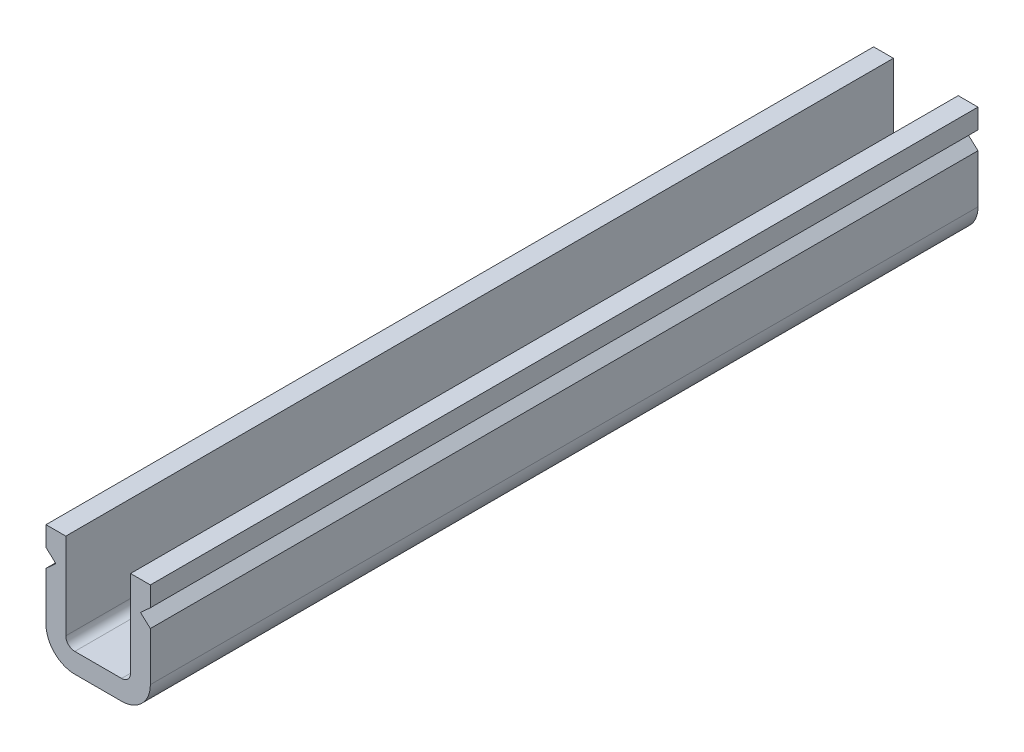
ISO-10303-21;
HEADER;
FILE_DESCRIPTION(('STEP AP214'),'2;1');
FILE_NAME('part.step','',(''),(''),'','','');
FILE_SCHEMA(('AUTOMOTIVE_DESIGN { 1 0 10303 214 1 1 1 1 }'));
ENDSEC;
DATA;
#1=APPLICATION_CONTEXT('core data for automotive mechanical design processes');
#2=APPLICATION_PROTOCOL_DEFINITION('international standard','automotive_design',2000,#1);
#3=PRODUCT_CONTEXT('',#1,'mechanical');
#4=PRODUCT('Part','Part','',(#3));
#5=PRODUCT_RELATED_PRODUCT_CATEGORY('part','',(#4));
#6=PRODUCT_DEFINITION_FORMATION('','',#4);
#7=PRODUCT_DEFINITION_CONTEXT('part definition',#1,'design');
#8=PRODUCT_DEFINITION('design','',#6,#7);
#9=PRODUCT_DEFINITION_SHAPE('','',#8);
#10=(LENGTH_UNIT() NAMED_UNIT(*) SI_UNIT(.MILLI.,.METRE.));
#11=(NAMED_UNIT(*) PLANE_ANGLE_UNIT() SI_UNIT($,.RADIAN.));
#12=(NAMED_UNIT(*) SI_UNIT($,.STERADIAN.) SOLID_ANGLE_UNIT());
#13=UNCERTAINTY_MEASURE_WITH_UNIT(LENGTH_MEASURE(1.E-05),#10,'distance_accuracy_value','');
#14=(GEOMETRIC_REPRESENTATION_CONTEXT(3) GLOBAL_UNCERTAINTY_ASSIGNED_CONTEXT((#13)) GLOBAL_UNIT_ASSIGNED_CONTEXT((#10,
#11,#12)) REPRESENTATION_CONTEXT('',''));
#15=CARTESIAN_POINT('',(0.,0.,0.));
#16=DIRECTION('',(0.,0.,1.));
#17=DIRECTION('',(1.,0.,0.));
#18=AXIS2_PLACEMENT_3D('',#15,#16,#17);
#19=CARTESIAN_POINT('',(1.09999999999999,0.,46.));
#20=DIRECTION('',(0.,-1.,0.));
#21=DIRECTION('',(1.,0.,0.));
#22=AXIS2_PLACEMENT_3D('',#19,#20,#21);
#23=PLANE('',#22);
#24=DIRECTION('',(-1.,0.,0.));
#25=VECTOR('',#24,1.);
#26=CARTESIAN_POINT('',(1.09999999999999,0.,0.));
#27=LINE('',#26,#25);
#28=CARTESIAN_POINT('',(1.09999999999999,0.,0.));
#29=VERTEX_POINT('',#28);
#30=CARTESIAN_POINT('',(0.,0.,0.));
#31=VERTEX_POINT('',#30);
#32=EDGE_CURVE('E187',#29,#31,#27,.T.);
#33=ORIENTED_EDGE('',*,*,#32,.T.);
#34=DIRECTION('',(0.,0.,-1.));
#35=VECTOR('',#34,1.);
#36=CARTESIAN_POINT('',(0.,0.,46.));
#37=LINE('',#36,#35);
#38=CARTESIAN_POINT('',(0.,0.,46.));
#39=VERTEX_POINT('',#38);
#40=EDGE_CURVE('E11',#39,#31,#37,.T.);
#41=ORIENTED_EDGE('',*,*,#40,.F.);
#42=DIRECTION('',(-1.,0.,0.));
#43=VECTOR('',#42,1.);
#44=CARTESIAN_POINT('',(1.09999999999999,0.,46.));
#45=LINE('',#44,#43);
#46=CARTESIAN_POINT('',(1.09999999999999,0.,46.));
#47=VERTEX_POINT('',#46);
#48=EDGE_CURVE('E221',#47,#39,#45,.T.);
#49=ORIENTED_EDGE('',*,*,#48,.F.);
#50=DIRECTION('',(0.,0.,-1.));
#51=VECTOR('',#50,1.);
#52=CARTESIAN_POINT('',(1.09999999999999,0.,46.));
#53=LINE('',#52,#51);
#54=EDGE_CURVE('E183',#47,#29,#53,.T.);
#55=ORIENTED_EDGE('',*,*,#54,.T.);
#56=EDGE_LOOP('',(#33,#41,#49,#55));
#57=FACE_BOUND('',#56,.T.);
#58=ADVANCED_FACE('F31',(#57),#23,.F.);
#59=CARTESIAN_POINT('',(0.,0.,46.));
#60=DIRECTION('',(1.,0.,0.));
#61=DIRECTION('',(0.,0.,-1.));
#62=AXIS2_PLACEMENT_3D('',#59,#60,#61);
#63=PLANE('',#62);
#64=DIRECTION('',(0.,-1.,0.));
#65=VECTOR('',#64,1.);
#66=CARTESIAN_POINT('',(0.,0.,0.));
#67=LINE('',#66,#65);
#68=CARTESIAN_POINT('',(0.,-1.1,0.));
#69=VERTEX_POINT('',#68);
#70=EDGE_CURVE('E190',#31,#69,#67,.T.);
#71=ORIENTED_EDGE('',*,*,#70,.T.);
#72=DIRECTION('',(0.,0.,-1.));
#73=VECTOR('',#72,1.);
#74=CARTESIAN_POINT('',(0.,-1.1,46.));
#75=LINE('',#74,#73);
#76=CARTESIAN_POINT('',(0.,-1.1,46.));
#77=VERTEX_POINT('',#76);
#78=EDGE_CURVE('E39',#77,#69,#75,.T.);
#79=ORIENTED_EDGE('',*,*,#78,.F.);
#80=DIRECTION('',(0.,-1.,0.));
#81=VECTOR('',#80,1.);
#82=CARTESIAN_POINT('',(0.,0.,46.));
#83=LINE('',#82,#81);
#84=EDGE_CURVE('E120',#39,#77,#83,.T.);
#85=ORIENTED_EDGE('',*,*,#84,.F.);
#86=ORIENTED_EDGE('',*,*,#40,.T.);
#87=EDGE_LOOP('',(#71,#79,#85,#86));
#88=FACE_BOUND('',#87,.T.);
#89=ADVANCED_FACE('F329',(#88),#63,.F.);
#90=CARTESIAN_POINT('',(0.,-1.1,46.));
#91=DIRECTION('',(0.672672793996313,0.739940073395944,0.));
#92=DIRECTION('',(-0.739940073395944,0.672672793996313,0.));
#93=AXIS2_PLACEMENT_3D('',#90,#91,#92);
#94=PLANE('',#93);
#95=DIRECTION('',(0.739940073395943,-0.672672793996313,0.));
#96=VECTOR('',#95,1.);
#97=CARTESIAN_POINT('',(0.,-1.1,0.));
#98=LINE('',#97,#96);
#99=CARTESIAN_POINT('',(0.549999999999995,-1.6,0.));
#100=VERTEX_POINT('',#99);
#101=EDGE_CURVE('E192',#69,#100,#98,.T.);
#102=ORIENTED_EDGE('',*,*,#101,.T.);
#103=DIRECTION('',(0.,0.,-1.));
#104=VECTOR('',#103,1.);
#105=CARTESIAN_POINT('',(0.549999999999995,-1.6,46.));
#106=LINE('',#105,#104);
#107=CARTESIAN_POINT('',(0.549999999999995,-1.6,46.));
#108=VERTEX_POINT('',#107);
#109=EDGE_CURVE('E258',#108,#100,#106,.T.);
#110=ORIENTED_EDGE('',*,*,#109,.F.);
#111=DIRECTION('',(0.739940073395943,-0.672672793996313,0.));
#112=VECTOR('',#111,1.);
#113=CARTESIAN_POINT('',(0.,-1.1,46.));
#114=LINE('',#113,#112);
#115=EDGE_CURVE('E266',#77,#108,#114,.T.);
#116=ORIENTED_EDGE('',*,*,#115,.F.);
#117=ORIENTED_EDGE('',*,*,#78,.T.);
#118=EDGE_LOOP('',(#102,#110,#116,#117));
#119=FACE_BOUND('',#118,.T.);
#120=ADVANCED_FACE('F264',(#119),#94,.F.);
#121=CARTESIAN_POINT('',(0.,-2.1,46.));
#122=DIRECTION('',(0.672672793996316,-0.739940073395941,0.));
#123=DIRECTION('',(0.739940073395941,0.672672793996316,0.));
#124=AXIS2_PLACEMENT_3D('',#121,#122,#123);
#125=PLANE('',#124);
#126=DIRECTION('',(-0.739940073395941,-0.672672793996316,0.));
#127=VECTOR('',#126,1.);
#128=CARTESIAN_POINT('',(0.,-2.1,0.));
#129=LINE('',#128,#127);
#130=CARTESIAN_POINT('',(0.,-2.1,0.));
#131=VERTEX_POINT('',#130);
#132=EDGE_CURVE('E194',#100,#131,#129,.T.);
#133=ORIENTED_EDGE('',*,*,#132,.T.);
#134=DIRECTION('',(0.,0.,-1.));
#135=VECTOR('',#134,1.);
#136=CARTESIAN_POINT('',(0.,-2.1,46.));
#137=LINE('',#136,#135);
#138=CARTESIAN_POINT('',(0.,-2.1,46.));
#139=VERTEX_POINT('',#138);
#140=EDGE_CURVE('E255',#139,#131,#137,.T.);
#141=ORIENTED_EDGE('',*,*,#140,.F.);
#142=DIRECTION('',(-0.739940073395941,-0.672672793996316,0.));
#143=VECTOR('',#142,1.);
#144=CARTESIAN_POINT('',(0.,-2.1,46.));
#145=LINE('',#144,#143);
#146=EDGE_CURVE('E284',#108,#139,#145,.T.);
#147=ORIENTED_EDGE('',*,*,#146,.F.);
#148=ORIENTED_EDGE('',*,*,#109,.T.);
#149=EDGE_LOOP('',(#133,#141,#147,#148));
#150=FACE_BOUND('',#149,.T.);
#151=ADVANCED_FACE('F275',(#150),#125,.F.);
#152=CARTESIAN_POINT('',(0.,-2.1,46.));
#153=DIRECTION('',(1.,0.,0.));
#154=DIRECTION('',(0.,1.,0.));
#155=AXIS2_PLACEMENT_3D('',#152,#153,#154);
#156=PLANE('',#155);
#157=DIRECTION('',(0.,-1.,0.));
#158=VECTOR('',#157,1.);
#159=CARTESIAN_POINT('',(0.,-2.1,0.));
#160=LINE('',#159,#158);
#161=CARTESIAN_POINT('',(0.,-4.79999999999998,0.));
#162=VERTEX_POINT('',#161);
#163=EDGE_CURVE('E196',#131,#162,#160,.T.);
#164=ORIENTED_EDGE('',*,*,#163,.T.);
#165=DIRECTION('',(0.,0.,-1.));
#166=VECTOR('',#165,1.);
#167=CARTESIAN_POINT('',(0.,-4.79999999999998,46.));
#168=LINE('',#167,#166);
#169=CARTESIAN_POINT('',(0.,-4.79999999999998,46.));
#170=VERTEX_POINT('',#169);
#171=EDGE_CURVE('E252',#170,#162,#168,.T.);
#172=ORIENTED_EDGE('',*,*,#171,.F.);
#173=DIRECTION('',(0.,-1.,0.));
#174=VECTOR('',#173,1.);
#175=CARTESIAN_POINT('',(0.,-2.1,46.));
#176=LINE('',#175,#174);
#177=EDGE_CURVE('E281',#139,#170,#176,.T.);
#178=ORIENTED_EDGE('',*,*,#177,.F.);
#179=ORIENTED_EDGE('',*,*,#140,.T.);
#180=EDGE_LOOP('',(#164,#172,#178,#179));
#181=FACE_BOUND('',#180,.T.);
#182=ADVANCED_FACE('F279',(#181),#156,.F.);
#183=CARTESIAN_POINT('',(1.6,-4.79999999999998,46.));
#184=DIRECTION('',(0.,0.,-1.));
#185=DIRECTION('',(-1.,0.,0.));
#186=AXIS2_PLACEMENT_3D('',#183,#184,#185);
#187=CYLINDRICAL_SURFACE('',#186,1.6);
#188=CARTESIAN_POINT('',(1.6,-4.79999999999998,0.));
#189=DIRECTION('',(0.,0.,1.));
#190=DIRECTION('',(1.,0.,0.));
#191=AXIS2_PLACEMENT_3D('',#188,#189,#190);
#192=CIRCLE('',#191,1.6);
#193=CARTESIAN_POINT('',(1.6,-6.39999999999998,0.));
#194=VERTEX_POINT('',#193);
#195=EDGE_CURVE('E198',#162,#194,#192,.T.);
#196=ORIENTED_EDGE('',*,*,#195,.T.);
#197=DIRECTION('',(0.,0.,-1.));
#198=VECTOR('',#197,1.);
#199=CARTESIAN_POINT('',(1.6,-6.39999999999998,46.));
#200=LINE('',#199,#198);
#201=CARTESIAN_POINT('',(1.6,-6.39999999999998,46.));
#202=VERTEX_POINT('',#201);
#203=EDGE_CURVE('E249',#202,#194,#200,.T.);
#204=ORIENTED_EDGE('',*,*,#203,.F.);
#205=CARTESIAN_POINT('',(1.6,-4.79999999999998,46.));
#206=DIRECTION('',(0.,0.,1.));
#207=DIRECTION('',(1.,0.,0.));
#208=AXIS2_PLACEMENT_3D('',#205,#206,#207);
#209=CIRCLE('',#208,1.6);
#210=EDGE_CURVE('E283',#170,#202,#209,.T.);
#211=ORIENTED_EDGE('',*,*,#210,.F.);
#212=ORIENTED_EDGE('',*,*,#171,.T.);
#213=EDGE_LOOP('',(#196,#204,#211,#212));
#214=FACE_BOUND('',#213,.T.);
#215=ADVANCED_FACE('F342',(#214),#187,.T.);
#216=CARTESIAN_POINT('',(1.6,-6.39999999999998,46.));
#217=DIRECTION('',(0.,1.,0.));
#218=DIRECTION('',(0.,0.,1.));
#219=AXIS2_PLACEMENT_3D('',#216,#217,#218);
#220=PLANE('',#219);
#221=DIRECTION('',(1.,0.,0.));
#222=VECTOR('',#221,1.);
#223=CARTESIAN_POINT('',(1.6,-6.39999999999998,0.));
#224=LINE('',#223,#222);
#225=CARTESIAN_POINT('',(4.19999999999997,-6.39999999999998,0.));
#226=VERTEX_POINT('',#225);
#227=EDGE_CURVE('E200',#194,#226,#224,.T.);
#228=ORIENTED_EDGE('',*,*,#227,.T.);
#229=DIRECTION('',(0.,0.,-1.));
#230=VECTOR('',#229,1.);
#231=CARTESIAN_POINT('',(4.19999999999997,-6.39999999999998,46.));
#232=LINE('',#231,#230);
#233=CARTESIAN_POINT('',(4.19999999999997,-6.39999999999998,46.));
#234=VERTEX_POINT('',#233);
#235=EDGE_CURVE('E246',#234,#226,#232,.T.);
#236=ORIENTED_EDGE('',*,*,#235,.F.);
#237=DIRECTION('',(1.,0.,0.));
#238=VECTOR('',#237,1.);
#239=CARTESIAN_POINT('',(1.6,-6.39999999999998,46.));
#240=LINE('',#239,#238);
#241=EDGE_CURVE('E286',#202,#234,#240,.T.);
#242=ORIENTED_EDGE('',*,*,#241,.F.);
#243=ORIENTED_EDGE('',*,*,#203,.T.);
#244=EDGE_LOOP('',(#228,#236,#242,#243));
#245=FACE_BOUND('',#244,.T.);
#246=ADVANCED_FACE('F345',(#245),#220,.F.);
#247=CARTESIAN_POINT('',(4.19999999999997,-4.79999999999998,46.));
#248=DIRECTION('',(0.,0.,-1.));
#249=DIRECTION('',(-1.,0.,0.));
#250=AXIS2_PLACEMENT_3D('',#247,#248,#249);
#251=CYLINDRICAL_SURFACE('',#250,1.6);
#252=CARTESIAN_POINT('',(4.19999999999997,-4.79999999999998,0.));
#253=DIRECTION('',(0.,0.,1.));
#254=DIRECTION('',(1.,0.,0.));
#255=AXIS2_PLACEMENT_3D('',#252,#253,#254);
#256=CIRCLE('',#255,1.6);
#257=CARTESIAN_POINT('',(5.79999999999997,-4.79999999999998,0.));
#258=VERTEX_POINT('',#257);
#259=EDGE_CURVE('E202',#226,#258,#256,.T.);
#260=ORIENTED_EDGE('',*,*,#259,.T.);
#261=DIRECTION('',(0.,0.,-1.));
#262=VECTOR('',#261,1.);
#263=CARTESIAN_POINT('',(5.79999999999997,-4.79999999999998,46.));
#264=LINE('',#263,#262);
#265=CARTESIAN_POINT('',(5.79999999999997,-4.79999999999998,46.));
#266=VERTEX_POINT('',#265);
#267=EDGE_CURVE('E243',#266,#258,#264,.T.);
#268=ORIENTED_EDGE('',*,*,#267,.F.);
#269=CARTESIAN_POINT('',(4.19999999999997,-4.79999999999998,46.));
#270=DIRECTION('',(0.,0.,1.));
#271=DIRECTION('',(1.,0.,0.));
#272=AXIS2_PLACEMENT_3D('',#269,#270,#271);
#273=CIRCLE('',#272,1.6);
#274=EDGE_CURVE('E292',#234,#266,#273,.T.);
#275=ORIENTED_EDGE('',*,*,#274,.F.);
#276=ORIENTED_EDGE('',*,*,#235,.T.);
#277=EDGE_LOOP('',(#260,#268,#275,#276));
#278=FACE_BOUND('',#277,.T.);
#279=ADVANCED_FACE('F349',(#278),#251,.T.);
#280=CARTESIAN_POINT('',(5.79999999999998,-4.79999999999998,46.));
#281=DIRECTION('',(-1.,0.,0.));
#282=DIRECTION('',(0.,-1.,0.));
#283=AXIS2_PLACEMENT_3D('',#280,#281,#282);
#284=PLANE('',#283);
#285=DIRECTION('',(0.,1.,0.));
#286=VECTOR('',#285,1.);
#287=CARTESIAN_POINT('',(5.79999999999998,-4.79999999999998,0.));
#288=LINE('',#287,#286);
#289=CARTESIAN_POINT('',(5.79999999999997,-2.1,0.));
#290=VERTEX_POINT('',#289);
#291=EDGE_CURVE('E204',#258,#290,#288,.T.);
#292=ORIENTED_EDGE('',*,*,#291,.T.);
#293=DIRECTION('',(0.,0.,-1.));
#294=VECTOR('',#293,1.);
#295=CARTESIAN_POINT('',(5.79999999999997,-2.1,46.));
#296=LINE('',#295,#294);
#297=CARTESIAN_POINT('',(5.79999999999997,-2.1,46.));
#298=VERTEX_POINT('',#297);
#299=EDGE_CURVE('E240',#298,#290,#296,.T.);
#300=ORIENTED_EDGE('',*,*,#299,.F.);
#301=DIRECTION('',(0.,1.,0.));
#302=VECTOR('',#301,1.);
#303=CARTESIAN_POINT('',(5.79999999999998,-4.79999999999998,46.));
#304=LINE('',#303,#302);
#305=EDGE_CURVE('E294',#266,#298,#304,.T.);
#306=ORIENTED_EDGE('',*,*,#305,.F.);
#307=ORIENTED_EDGE('',*,*,#267,.T.);
#308=EDGE_LOOP('',(#292,#300,#306,#307));
#309=FACE_BOUND('',#308,.T.);
#310=ADVANCED_FACE('F353',(#309),#284,.F.);
#311=CARTESIAN_POINT('',(5.79999999999997,-2.1,46.));
#312=DIRECTION('',(-0.672672793996319,-0.739940073395937,0.));
#313=DIRECTION('',(0.739940073395937,-0.672672793996319,0.));
#314=AXIS2_PLACEMENT_3D('',#311,#312,#313);
#315=PLANE('',#314);
#316=DIRECTION('',(-0.739940073395937,0.672672793996319,0.));
#317=VECTOR('',#316,1.);
#318=CARTESIAN_POINT('',(5.79999999999997,-2.1,0.));
#319=LINE('',#318,#317);
#320=CARTESIAN_POINT('',(5.24999999999999,-1.6,0.));
#321=VERTEX_POINT('',#320);
#322=EDGE_CURVE('E206',#290,#321,#319,.T.);
#323=ORIENTED_EDGE('',*,*,#322,.T.);
#324=DIRECTION('',(0.,0.,-1.));
#325=VECTOR('',#324,1.);
#326=CARTESIAN_POINT('',(5.24999999999999,-1.6,46.));
#327=LINE('',#326,#325);
#328=CARTESIAN_POINT('',(5.24999999999999,-1.6,46.));
#329=VERTEX_POINT('',#328);
#330=EDGE_CURVE('E237',#329,#321,#327,.T.);
#331=ORIENTED_EDGE('',*,*,#330,.F.);
#332=DIRECTION('',(-0.739940073395937,0.672672793996319,0.));
#333=VECTOR('',#332,1.);
#334=CARTESIAN_POINT('',(5.79999999999997,-2.1,46.));
#335=LINE('',#334,#333);
#336=EDGE_CURVE('E296',#298,#329,#335,.T.);
#337=ORIENTED_EDGE('',*,*,#336,.F.);
#338=ORIENTED_EDGE('',*,*,#299,.T.);
#339=EDGE_LOOP('',(#323,#331,#337,#338));
#340=FACE_BOUND('',#339,.T.);
#341=ADVANCED_FACE('F357',(#340),#315,.F.);
#342=CARTESIAN_POINT('',(5.79999999999997,-1.1,46.));
#343=DIRECTION('',(-0.672672793996316,0.73994007339594,0.));
#344=DIRECTION('',(-0.73994007339594,-0.672672793996317,0.));
#345=AXIS2_PLACEMENT_3D('',#342,#343,#344);
#346=PLANE('',#345);
#347=DIRECTION('',(0.73994007339594,0.672672793996317,0.));
#348=VECTOR('',#347,1.);
#349=CARTESIAN_POINT('',(5.79999999999997,-1.1,0.));
#350=LINE('',#349,#348);
#351=CARTESIAN_POINT('',(5.79999999999997,-1.1,0.));
#352=VERTEX_POINT('',#351);
#353=EDGE_CURVE('E208',#321,#352,#350,.T.);
#354=ORIENTED_EDGE('',*,*,#353,.T.);
#355=DIRECTION('',(0.,0.,-1.));
#356=VECTOR('',#355,1.);
#357=CARTESIAN_POINT('',(5.79999999999997,-1.1,46.));
#358=LINE('',#357,#356);
#359=CARTESIAN_POINT('',(5.79999999999997,-1.1,46.));
#360=VERTEX_POINT('',#359);
#361=EDGE_CURVE('E234',#360,#352,#358,.T.);
#362=ORIENTED_EDGE('',*,*,#361,.F.);
#363=DIRECTION('',(0.73994007339594,0.672672793996317,0.));
#364=VECTOR('',#363,1.);
#365=CARTESIAN_POINT('',(5.79999999999997,-1.1,46.));
#366=LINE('',#365,#364);
#367=EDGE_CURVE('E298',#329,#360,#366,.T.);
#368=ORIENTED_EDGE('',*,*,#367,.F.);
#369=ORIENTED_EDGE('',*,*,#330,.T.);
#370=EDGE_LOOP('',(#354,#362,#368,#369));
#371=FACE_BOUND('',#370,.T.);
#372=ADVANCED_FACE('F361',(#371),#346,.F.);
#373=CARTESIAN_POINT('',(5.79999999999997,-1.1,46.));
#374=DIRECTION('',(-1.,0.,0.));
#375=DIRECTION('',(0.,0.,1.));
#376=AXIS2_PLACEMENT_3D('',#373,#374,#375);
#377=PLANE('',#376);
#378=DIRECTION('',(0.,1.,0.));
#379=VECTOR('',#378,1.);
#380=CARTESIAN_POINT('',(5.79999999999997,-1.1,0.));
#381=LINE('',#380,#379);
#382=CARTESIAN_POINT('',(5.79999999999997,0.,0.));
#383=VERTEX_POINT('',#382);
#384=EDGE_CURVE('E210',#352,#383,#381,.T.);
#385=ORIENTED_EDGE('',*,*,#384,.T.);
#386=DIRECTION('',(0.,0.,-1.));
#387=VECTOR('',#386,1.);
#388=CARTESIAN_POINT('',(5.79999999999997,0.,46.));
#389=LINE('',#388,#387);
#390=CARTESIAN_POINT('',(5.79999999999997,0.,46.));
#391=VERTEX_POINT('',#390);
#392=EDGE_CURVE('E231',#391,#383,#389,.T.);
#393=ORIENTED_EDGE('',*,*,#392,.F.);
#394=DIRECTION('',(0.,1.,0.));
#395=VECTOR('',#394,1.);
#396=CARTESIAN_POINT('',(5.79999999999997,-1.1,46.));
#397=LINE('',#396,#395);
#398=EDGE_CURVE('E300',#360,#391,#397,.T.);
#399=ORIENTED_EDGE('',*,*,#398,.F.);
#400=ORIENTED_EDGE('',*,*,#361,.T.);
#401=EDGE_LOOP('',(#385,#393,#399,#400));
#402=FACE_BOUND('',#401,.T.);
#403=ADVANCED_FACE('F365',(#402),#377,.F.);
#404=CARTESIAN_POINT('',(5.79999999999997,0.,46.));
#405=DIRECTION('',(0.,-1.,0.));
#406=DIRECTION('',(1.,0.,0.));
#407=AXIS2_PLACEMENT_3D('',#404,#405,#406);
#408=PLANE('',#407);
#409=DIRECTION('',(-1.,0.,0.));
#410=VECTOR('',#409,1.);
#411=CARTESIAN_POINT('',(5.79999999999997,0.,0.));
#412=LINE('',#411,#410);
#413=CARTESIAN_POINT('',(4.69999999999999,0.,0.));
#414=VERTEX_POINT('',#413);
#415=EDGE_CURVE('E212',#383,#414,#412,.T.);
#416=ORIENTED_EDGE('',*,*,#415,.T.);
#417=DIRECTION('',(0.,0.,-1.));
#418=VECTOR('',#417,1.);
#419=CARTESIAN_POINT('',(4.69999999999999,0.,46.));
#420=LINE('',#419,#418);
#421=CARTESIAN_POINT('',(4.69999999999999,0.,46.));
#422=VERTEX_POINT('',#421);
#423=EDGE_CURVE('E228',#422,#414,#420,.T.);
#424=ORIENTED_EDGE('',*,*,#423,.F.);
#425=DIRECTION('',(-1.,0.,0.));
#426=VECTOR('',#425,1.);
#427=CARTESIAN_POINT('',(5.79999999999997,0.,46.));
#428=LINE('',#427,#426);
#429=EDGE_CURVE('E302',#391,#422,#428,.T.);
#430=ORIENTED_EDGE('',*,*,#429,.F.);
#431=ORIENTED_EDGE('',*,*,#392,.T.);
#432=EDGE_LOOP('',(#416,#424,#430,#431));
#433=FACE_BOUND('',#432,.T.);
#434=ADVANCED_FACE('F369',(#433),#408,.F.);
#435=CARTESIAN_POINT('',(4.69999999999999,-4.8,46.));
#436=DIRECTION('',(1.,0.,0.));
#437=DIRECTION('',(0.,0.,-1.));
#438=AXIS2_PLACEMENT_3D('',#435,#436,#437);
#439=PLANE('',#438);
#440=DIRECTION('',(0.,-1.,0.));
#441=VECTOR('',#440,1.);
#442=CARTESIAN_POINT('',(4.69999999999999,-4.8,0.));
#443=LINE('',#442,#441);
#444=CARTESIAN_POINT('',(4.69999999999999,-4.8,0.));
#445=VERTEX_POINT('',#444);
#446=EDGE_CURVE('E214',#414,#445,#443,.T.);
#447=ORIENTED_EDGE('',*,*,#446,.T.);
#448=DIRECTION('',(0.,0.,-1.));
#449=VECTOR('',#448,1.);
#450=CARTESIAN_POINT('',(4.69999999999999,-4.8,46.));
#451=LINE('',#450,#449);
#452=CARTESIAN_POINT('',(4.69999999999999,-4.8,46.));
#453=VERTEX_POINT('',#452);
#454=EDGE_CURVE('E225',#453,#445,#451,.T.);
#455=ORIENTED_EDGE('',*,*,#454,.F.);
#456=DIRECTION('',(0.,-1.,0.));
#457=VECTOR('',#456,1.);
#458=CARTESIAN_POINT('',(4.69999999999999,-4.8,46.));
#459=LINE('',#458,#457);
#460=EDGE_CURVE('E304',#422,#453,#459,.T.);
#461=ORIENTED_EDGE('',*,*,#460,.F.);
#462=ORIENTED_EDGE('',*,*,#423,.T.);
#463=EDGE_LOOP('',(#447,#455,#461,#462));
#464=FACE_BOUND('',#463,.T.);
#465=ADVANCED_FACE('F310',(#464),#439,.F.);
#466=CARTESIAN_POINT('',(4.19999999999999,-4.8,46.));
#467=DIRECTION('',(0.,0.,-1.));
#468=DIRECTION('',(-1.,0.,0.));
#469=AXIS2_PLACEMENT_3D('',#466,#467,#468);
#470=CYLINDRICAL_SURFACE('',#469,0.5);
#471=CARTESIAN_POINT('',(4.19999999999999,-4.8,0.));
#472=DIRECTION('',(0.,0.,-1.));
#473=DIRECTION('',(-1.,0.,0.));
#474=AXIS2_PLACEMENT_3D('',#471,#472,#473);
#475=CIRCLE('',#474,0.5);
#476=CARTESIAN_POINT('',(4.19999999999999,-5.3,0.));
#477=VERTEX_POINT('',#476);
#478=EDGE_CURVE('E216',#445,#477,#475,.T.);
#479=ORIENTED_EDGE('',*,*,#478,.T.);
#480=DIRECTION('',(0.,0.,-1.));
#481=VECTOR('',#480,1.);
#482=CARTESIAN_POINT('',(4.19999999999999,-5.3,46.));
#483=LINE('',#482,#481);
#484=CARTESIAN_POINT('',(4.19999999999999,-5.3,46.));
#485=VERTEX_POINT('',#484);
#486=EDGE_CURVE('E178',#485,#477,#483,.T.);
#487=ORIENTED_EDGE('',*,*,#486,.F.);
#488=CARTESIAN_POINT('',(4.19999999999999,-4.8,46.));
#489=DIRECTION('',(0.,0.,-1.));
#490=DIRECTION('',(-1.,0.,0.));
#491=AXIS2_PLACEMENT_3D('',#488,#489,#490);
#492=CIRCLE('',#491,0.5);
#493=EDGE_CURVE('E169',#453,#485,#492,.T.);
#494=ORIENTED_EDGE('',*,*,#493,.F.);
#495=ORIENTED_EDGE('',*,*,#454,.T.);
#496=EDGE_LOOP('',(#479,#487,#494,#495));
#497=FACE_BOUND('',#496,.T.);
#498=ADVANCED_FACE('F314',(#497),#470,.F.);
#499=CARTESIAN_POINT('',(1.59999999999999,-5.3,46.));
#500=DIRECTION('',(0.,-1.,0.));
#501=DIRECTION('',(0.,0.,-1.));
#502=AXIS2_PLACEMENT_3D('',#499,#500,#501);
#503=PLANE('',#502);
#504=DIRECTION('',(-1.,0.,0.));
#505=VECTOR('',#504,1.);
#506=CARTESIAN_POINT('',(1.59999999999999,-5.3,0.));
#507=LINE('',#506,#505);
#508=CARTESIAN_POINT('',(1.59999999999999,-5.3,0.));
#509=VERTEX_POINT('',#508);
#510=EDGE_CURVE('E177',#477,#509,#507,.T.);
#511=ORIENTED_EDGE('',*,*,#510,.T.);
#512=DIRECTION('',(0.,0.,-1.));
#513=VECTOR('',#512,1.);
#514=CARTESIAN_POINT('',(1.59999999999999,-5.3,46.));
#515=LINE('',#514,#513);
#516=CARTESIAN_POINT('',(1.59999999999999,-5.3,46.));
#517=VERTEX_POINT('',#516);
#518=EDGE_CURVE('E174',#517,#509,#515,.T.);
#519=ORIENTED_EDGE('',*,*,#518,.F.);
#520=DIRECTION('',(-1.,0.,0.));
#521=VECTOR('',#520,1.);
#522=CARTESIAN_POINT('',(1.59999999999999,-5.3,46.));
#523=LINE('',#522,#521);
#524=EDGE_CURVE('E163',#485,#517,#523,.T.);
#525=ORIENTED_EDGE('',*,*,#524,.F.);
#526=ORIENTED_EDGE('',*,*,#486,.T.);
#527=EDGE_LOOP('',(#511,#519,#525,#526));
#528=FACE_BOUND('',#527,.T.);
#529=ADVANCED_FACE('F175',(#528),#503,.F.);
#530=CARTESIAN_POINT('',(1.59999999999999,-4.8,46.));
#531=DIRECTION('',(0.,0.,-1.));
#532=DIRECTION('',(-1.,0.,0.));
#533=AXIS2_PLACEMENT_3D('',#530,#531,#532);
#534=CYLINDRICAL_SURFACE('',#533,0.5);
#535=CARTESIAN_POINT('',(1.59999999999999,-4.8,0.));
#536=DIRECTION('',(0.,0.,-1.));
#537=DIRECTION('',(1.,0.,0.));
#538=AXIS2_PLACEMENT_3D('',#535,#536,#537);
#539=CIRCLE('',#538,0.5);
#540=CARTESIAN_POINT('',(1.09999999999999,-4.8,0.));
#541=VERTEX_POINT('',#540);
#542=EDGE_CURVE('E106',#509,#541,#539,.T.);
#543=ORIENTED_EDGE('',*,*,#542,.T.);
#544=DIRECTION('',(0.,0.,-1.));
#545=VECTOR('',#544,1.);
#546=CARTESIAN_POINT('',(1.09999999999999,-4.8,46.));
#547=LINE('',#546,#545);
#548=CARTESIAN_POINT('',(1.09999999999999,-4.8,46.));
#549=VERTEX_POINT('',#548);
#550=EDGE_CURVE('E179',#549,#541,#547,.T.);
#551=ORIENTED_EDGE('',*,*,#550,.F.);
#552=CARTESIAN_POINT('',(1.59999999999999,-4.8,46.));
#553=DIRECTION('',(0.,0.,-1.));
#554=DIRECTION('',(1.,0.,0.));
#555=AXIS2_PLACEMENT_3D('',#552,#553,#554);
#556=CIRCLE('',#555,0.5);
#557=EDGE_CURVE('E167',#517,#549,#556,.T.);
#558=ORIENTED_EDGE('',*,*,#557,.F.);
#559=ORIENTED_EDGE('',*,*,#518,.T.);
#560=EDGE_LOOP('',(#543,#551,#558,#559));
#561=FACE_BOUND('',#560,.T.);
#562=ADVANCED_FACE('F181',(#561),#534,.F.);
#563=CARTESIAN_POINT('',(1.09999999999999,0.,46.));
#564=DIRECTION('',(-1.,0.,0.));
#565=DIRECTION('',(0.,-1.,0.));
#566=AXIS2_PLACEMENT_3D('',#563,#564,#565);
#567=PLANE('',#566);
#568=DIRECTION('',(0.,1.,0.));
#569=VECTOR('',#568,1.);
#570=CARTESIAN_POINT('',(1.09999999999999,0.,0.));
#571=LINE('',#570,#569);
#572=EDGE_CURVE('E112',#541,#29,#571,.T.);
#573=ORIENTED_EDGE('',*,*,#572,.T.);
#574=ORIENTED_EDGE('',*,*,#54,.F.);
#575=DIRECTION('',(0.,1.,0.));
#576=VECTOR('',#575,1.);
#577=CARTESIAN_POINT('',(1.09999999999999,0.,46.));
#578=LINE('',#577,#576);
#579=EDGE_CURVE('E47',#549,#47,#578,.T.);
#580=ORIENTED_EDGE('',*,*,#579,.F.);
#581=ORIENTED_EDGE('',*,*,#550,.T.);
#582=EDGE_LOOP('',(#573,#574,#580,#581));
#583=FACE_BOUND('',#582,.T.);
#584=ADVANCED_FACE('F318',(#583),#567,.F.);
#585=CARTESIAN_POINT('',(1.6,-4.79999999999998,46.));
#586=DIRECTION('',(0.,0.,1.));
#587=DIRECTION('',(1.,0.,0.));
#588=AXIS2_PLACEMENT_3D('',#585,#586,#587);
#589=PLANE('',#588);
#590=ORIENTED_EDGE('',*,*,#48,.T.);
#591=ORIENTED_EDGE('',*,*,#84,.T.);
#592=ORIENTED_EDGE('',*,*,#115,.T.);
#593=ORIENTED_EDGE('',*,*,#146,.T.);
#594=ORIENTED_EDGE('',*,*,#177,.T.);
#595=ORIENTED_EDGE('',*,*,#210,.T.);
#596=ORIENTED_EDGE('',*,*,#241,.T.);
#597=ORIENTED_EDGE('',*,*,#274,.T.);
#598=ORIENTED_EDGE('',*,*,#305,.T.);
#599=ORIENTED_EDGE('',*,*,#336,.T.);
#600=ORIENTED_EDGE('',*,*,#367,.T.);
#601=ORIENTED_EDGE('',*,*,#398,.T.);
#602=ORIENTED_EDGE('',*,*,#429,.T.);
#603=ORIENTED_EDGE('',*,*,#460,.T.);
#604=ORIENTED_EDGE('',*,*,#493,.T.);
#605=ORIENTED_EDGE('',*,*,#524,.T.);
#606=ORIENTED_EDGE('',*,*,#557,.T.);
#607=ORIENTED_EDGE('',*,*,#579,.T.);
#608=EDGE_LOOP('',(#590,#591,#592,#593,#594,#595,#596,#597,#598,#599,#600,#601,#602,#603,#604,
#605,#606,#607));
#609=FACE_BOUND('',#608,.T.);
#610=ADVANCED_FACE('F165',(#609),#589,.T.);
#611=CARTESIAN_POINT('',(1.6,-4.79999999999998,0.));
#612=DIRECTION('',(0.,0.,1.));
#613=DIRECTION('',(1.,0.,0.));
#614=AXIS2_PLACEMENT_3D('',#611,#612,#613);
#615=PLANE('',#614);
#616=ORIENTED_EDGE('',*,*,#32,.F.);
#617=ORIENTED_EDGE('',*,*,#572,.F.);
#618=ORIENTED_EDGE('',*,*,#542,.F.);
#619=ORIENTED_EDGE('',*,*,#510,.F.);
#620=ORIENTED_EDGE('',*,*,#478,.F.);
#621=ORIENTED_EDGE('',*,*,#446,.F.);
#622=ORIENTED_EDGE('',*,*,#415,.F.);
#623=ORIENTED_EDGE('',*,*,#384,.F.);
#624=ORIENTED_EDGE('',*,*,#353,.F.);
#625=ORIENTED_EDGE('',*,*,#322,.F.);
#626=ORIENTED_EDGE('',*,*,#291,.F.);
#627=ORIENTED_EDGE('',*,*,#259,.F.);
#628=ORIENTED_EDGE('',*,*,#227,.F.);
#629=ORIENTED_EDGE('',*,*,#195,.F.);
#630=ORIENTED_EDGE('',*,*,#163,.F.);
#631=ORIENTED_EDGE('',*,*,#132,.F.);
#632=ORIENTED_EDGE('',*,*,#101,.F.);
#633=ORIENTED_EDGE('',*,*,#70,.F.);
#634=EDGE_LOOP('',(#616,#617,#618,#619,#620,#621,#622,#623,#624,#625,#626,#627,#628,#629,#630,
#631,#632,#633));
#635=FACE_BOUND('',#634,.T.);
#636=ADVANCED_FACE('F270',(#635),#615,.F.);
#637=CLOSED_SHELL('',(#58,#89,#120,#151,#182,#215,#246,#279,#310,#341,#372,#403,#434,#465,#498,
#529,#562,#584,#610,#636));
#638=MANIFOLD_SOLID_BREP('B2',#637);
#639=ADVANCED_BREP_SHAPE_REPRESENTATION('',(#18,#638),#14);
#640=SHAPE_DEFINITION_REPRESENTATION(#9,#639);
ENDSEC;
END-ISO-10303-21;
